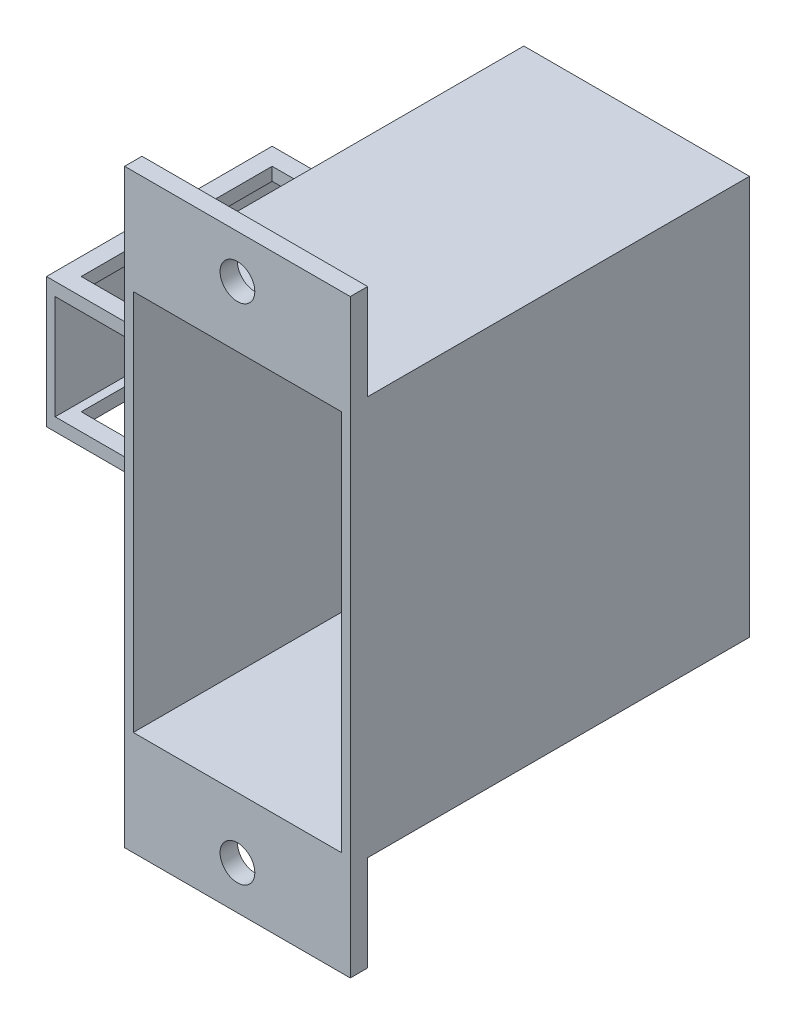
ISO-10303-21;
HEADER;
FILE_DESCRIPTION(('STEP AP214'),'2;1');
FILE_NAME('part.step','',(''),(''),'','','');
FILE_SCHEMA(('AUTOMOTIVE_DESIGN { 1 0 10303 214 1 1 1 1 }'));
ENDSEC;
DATA;
#1=APPLICATION_CONTEXT('core data for automotive mechanical design processes');
#2=APPLICATION_PROTOCOL_DEFINITION('international standard','automotive_design',2000,#1);
#3=PRODUCT_CONTEXT('',#1,'mechanical');
#4=PRODUCT('Part','Part','',(#3));
#5=PRODUCT_RELATED_PRODUCT_CATEGORY('part','',(#4));
#6=PRODUCT_DEFINITION_FORMATION('','',#4);
#7=PRODUCT_DEFINITION_CONTEXT('part definition',#1,'design');
#8=PRODUCT_DEFINITION('design','',#6,#7);
#9=PRODUCT_DEFINITION_SHAPE('','',#8);
#10=(LENGTH_UNIT() NAMED_UNIT(*) SI_UNIT(.MILLI.,.METRE.));
#11=(NAMED_UNIT(*) PLANE_ANGLE_UNIT() SI_UNIT($,.RADIAN.));
#12=(NAMED_UNIT(*) SI_UNIT($,.STERADIAN.) SOLID_ANGLE_UNIT());
#13=UNCERTAINTY_MEASURE_WITH_UNIT(LENGTH_MEASURE(1.E-05),#10,'distance_accuracy_value','');
#14=(GEOMETRIC_REPRESENTATION_CONTEXT(3) GLOBAL_UNCERTAINTY_ASSIGNED_CONTEXT((#13)) GLOBAL_UNIT_ASSIGNED_CONTEXT((#10,
#11,#12)) REPRESENTATION_CONTEXT('',''));
#15=CARTESIAN_POINT('',(0.,0.,0.));
#16=DIRECTION('',(0.,0.,1.));
#17=DIRECTION('',(1.,0.,0.));
#18=AXIS2_PLACEMENT_3D('',#15,#16,#17);
#19=CARTESIAN_POINT('',(-7.5,17.001,16.5));
#20=DIRECTION('',(1.,0.,0.));
#21=DIRECTION('',(0.,1.,0.));
#22=AXIS2_PLACEMENT_3D('',#19,#20,#21);
#23=PLANE('',#22);
#24=DIRECTION('',(0.,-1.,0.));
#25=VECTOR('',#24,1.);
#26=CARTESIAN_POINT('',(-7.5,17.001,16.5));
#27=LINE('',#26,#25);
#28=CARTESIAN_POINT('',(-7.5,-3.,16.5));
#29=VERTEX_POINT('',#28);
#30=CARTESIAN_POINT('',(-7.49999999999999,-3.74999999999999,16.5));
#31=VERTEX_POINT('',#30);
#32=EDGE_CURVE('E250',#29,#31,#27,.T.);
#33=ORIENTED_EDGE('',*,*,#32,.F.);
#34=DIRECTION('',(0.,0.,1.));
#35=VECTOR('',#34,1.);
#36=CARTESIAN_POINT('',(-7.5,-3.,-0.001000000000001));
#37=LINE('',#36,#35);
#38=CARTESIAN_POINT('',(-7.49999999999999,-3.,5.5));
#39=VERTEX_POINT('',#38);
#40=EDGE_CURVE('E555',#39,#29,#37,.T.);
#41=ORIENTED_EDGE('',*,*,#40,.F.);
#42=DIRECTION('',(0.,-1.,0.));
#43=VECTOR('',#42,1.);
#44=CARTESIAN_POINT('',(-7.5,17.001,5.5));
#45=LINE('',#44,#43);
#46=CARTESIAN_POINT('',(-7.5,-3.74999999999999,5.5));
#47=VERTEX_POINT('',#46);
#48=EDGE_CURVE('E611',#39,#47,#45,.T.);
#49=ORIENTED_EDGE('',*,*,#48,.T.);
#50=DIRECTION('',(0.,0.,1.));
#51=VECTOR('',#50,1.);
#52=CARTESIAN_POINT('',(-7.5,-3.74999999999999,16.5));
#53=LINE('',#52,#51);
#54=EDGE_CURVE('E600',#47,#31,#53,.T.);
#55=ORIENTED_EDGE('',*,*,#54,.T.);
#56=EDGE_LOOP('',(#33,#41,#49,#55));
#57=FACE_BOUND('',#56,.T.);
#58=ADVANCED_FACE('F36',(#57),#23,.F.);
#59=CARTESIAN_POINT('',(-15.5,17.001,5.5));
#60=DIRECTION('',(0.,0.,-1.));
#61=DIRECTION('',(-1.,0.,0.));
#62=AXIS2_PLACEMENT_3D('',#59,#60,#61);
#63=PLANE('',#62);
#64=ORIENTED_EDGE('',*,*,#48,.F.);
#65=DIRECTION('',(1.,0.,0.));
#66=VECTOR('',#65,1.);
#67=CARTESIAN_POINT('',(-16.,-3.,5.5));
#68=LINE('',#67,#66);
#69=CARTESIAN_POINT('',(-15.5,-3.,5.5));
#70=VERTEX_POINT('',#69);
#71=EDGE_CURVE('E571',#70,#39,#68,.T.);
#72=ORIENTED_EDGE('',*,*,#71,.F.);
#73=DIRECTION('',(0.,-1.,0.));
#74=VECTOR('',#73,1.);
#75=CARTESIAN_POINT('',(-15.5,17.001,5.5));
#76=LINE('',#75,#74);
#77=CARTESIAN_POINT('',(-15.5,-3.74999999999999,5.5));
#78=VERTEX_POINT('',#77);
#79=EDGE_CURVE('E614',#70,#78,#76,.T.);
#80=ORIENTED_EDGE('',*,*,#79,.T.);
#81=DIRECTION('',(1.,0.,0.));
#82=VECTOR('',#81,1.);
#83=CARTESIAN_POINT('',(-15.5,-3.74999999999999,5.5));
#84=LINE('',#83,#82);
#85=EDGE_CURVE('E254',#78,#47,#84,.T.);
#86=ORIENTED_EDGE('',*,*,#85,.T.);
#87=EDGE_LOOP('',(#64,#72,#80,#86));
#88=FACE_BOUND('',#87,.T.);
#89=ADVANCED_FACE('F442',(#88),#63,.F.);
#90=CARTESIAN_POINT('',(-15.5,17.001,16.5));
#91=DIRECTION('',(-1.,0.,0.));
#92=DIRECTION('',(0.,-1.,0.));
#93=AXIS2_PLACEMENT_3D('',#90,#91,#92);
#94=PLANE('',#93);
#95=ORIENTED_EDGE('',*,*,#79,.F.);
#96=DIRECTION('',(0.,0.,-1.));
#97=VECTOR('',#96,1.);
#98=CARTESIAN_POINT('',(-15.5,-3.,-0.001000000000001));
#99=LINE('',#98,#97);
#100=CARTESIAN_POINT('',(-15.5,-3.,16.5));
#101=VERTEX_POINT('',#100);
#102=EDGE_CURVE('E636',#101,#70,#99,.T.);
#103=ORIENTED_EDGE('',*,*,#102,.F.);
#104=DIRECTION('',(0.,-1.,0.));
#105=VECTOR('',#104,1.);
#106=CARTESIAN_POINT('',(-15.5,17.001,16.5));
#107=LINE('',#106,#105);
#108=CARTESIAN_POINT('',(-15.5,-3.74999999999999,16.5));
#109=VERTEX_POINT('',#108);
#110=EDGE_CURVE('E249',#101,#109,#107,.T.);
#111=ORIENTED_EDGE('',*,*,#110,.T.);
#112=DIRECTION('',(0.,0.,-1.));
#113=VECTOR('',#112,1.);
#114=CARTESIAN_POINT('',(-15.5,-3.74999999999999,16.5));
#115=LINE('',#114,#113);
#116=EDGE_CURVE('E606',#109,#78,#115,.T.);
#117=ORIENTED_EDGE('',*,*,#116,.T.);
#118=EDGE_LOOP('',(#95,#103,#111,#117));
#119=FACE_BOUND('',#118,.T.);
#120=ADVANCED_FACE('F449',(#119),#94,.F.);
#121=CARTESIAN_POINT('',(-15.5,17.001,16.5));
#122=DIRECTION('',(0.,0.,1.));
#123=DIRECTION('',(1.,0.,0.));
#124=AXIS2_PLACEMENT_3D('',#121,#122,#123);
#125=PLANE('',#124);
#126=ORIENTED_EDGE('',*,*,#110,.F.);
#127=DIRECTION('',(-1.,0.,0.));
#128=VECTOR('',#127,1.);
#129=CARTESIAN_POINT('',(-16.,-3.,16.5));
#130=LINE('',#129,#128);
#131=EDGE_CURVE('E635',#29,#101,#130,.T.);
#132=ORIENTED_EDGE('',*,*,#131,.F.);
#133=ORIENTED_EDGE('',*,*,#32,.T.);
#134=DIRECTION('',(-1.,0.,0.));
#135=VECTOR('',#134,1.);
#136=CARTESIAN_POINT('',(-15.5,-3.74999999999999,16.5));
#137=LINE('',#136,#135);
#138=EDGE_CURVE('E603',#31,#109,#137,.T.);
#139=ORIENTED_EDGE('',*,*,#138,.T.);
#140=EDGE_LOOP('',(#126,#132,#133,#139));
#141=FACE_BOUND('',#140,.T.);
#142=ADVANCED_FACE('F519',(#141),#125,.F.);
#143=CARTESIAN_POINT('',(-6.5,11.5,23.));
#144=DIRECTION('',(1.,0.,0.));
#145=DIRECTION('',(0.,1.,0.));
#146=AXIS2_PLACEMENT_3D('',#143,#144,#145);
#147=PLANE('',#146);
#148=DIRECTION('',(0.,-1.,0.));
#149=VECTOR('',#148,1.);
#150=CARTESIAN_POINT('',(-6.5,11.5,0.));
#151=LINE('',#150,#149);
#152=CARTESIAN_POINT('',(-6.5,11.5,0.));
#153=VERTEX_POINT('',#152);
#154=CARTESIAN_POINT('',(-6.5,-11.5,0.));
#155=VERTEX_POINT('',#154);
#156=EDGE_CURVE('E381',#153,#155,#151,.T.);
#157=ORIENTED_EDGE('',*,*,#156,.T.);
#158=DIRECTION('',(0.,0.,-1.));
#159=VECTOR('',#158,1.);
#160=CARTESIAN_POINT('',(-6.5,-11.5,23.));
#161=LINE('',#160,#159);
#162=CARTESIAN_POINT('',(-6.5,-11.5,22.));
#163=VERTEX_POINT('',#162);
#164=EDGE_CURVE('E45',#163,#155,#161,.T.);
#165=ORIENTED_EDGE('',*,*,#164,.F.);
#166=DIRECTION('',(0.,-1.,0.));
#167=VECTOR('',#166,1.);
#168=CARTESIAN_POINT('',(-6.49999999999999,-11.5,22.));
#169=LINE('',#168,#167);
#170=CARTESIAN_POINT('',(-6.5,-17.,22.));
#171=VERTEX_POINT('',#170);
#172=EDGE_CURVE('E307',#163,#171,#169,.T.);
#173=ORIENTED_EDGE('',*,*,#172,.T.);
#174=DIRECTION('',(0.,0.,1.));
#175=VECTOR('',#174,1.);
#176=CARTESIAN_POINT('',(-6.5,-17.,22.));
#177=LINE('',#176,#175);
#178=CARTESIAN_POINT('',(-6.5,-17.,23.));
#179=VERTEX_POINT('',#178);
#180=EDGE_CURVE('E313',#171,#179,#177,.T.);
#181=ORIENTED_EDGE('',*,*,#180,.T.);
#182=DIRECTION('',(0.,-1.,0.));
#183=VECTOR('',#182,1.);
#184=CARTESIAN_POINT('',(-6.5,11.5,23.));
#185=LINE('',#184,#183);
#186=CARTESIAN_POINT('',(-6.5,17.,23.));
#187=VERTEX_POINT('',#186);
#188=EDGE_CURVE('E380',#187,#179,#185,.T.);
#189=ORIENTED_EDGE('',*,*,#188,.F.);
#190=DIRECTION('',(0.,0.,1.));
#191=VECTOR('',#190,1.);
#192=CARTESIAN_POINT('',(-6.5,17.,22.));
#193=LINE('',#192,#191);
#194=CARTESIAN_POINT('',(-6.5,17.,22.));
#195=VERTEX_POINT('',#194);
#196=EDGE_CURVE('E340',#195,#187,#193,.T.);
#197=ORIENTED_EDGE('',*,*,#196,.F.);
#198=DIRECTION('',(0.,-1.,0.));
#199=VECTOR('',#198,1.);
#200=CARTESIAN_POINT('',(-6.5,11.5,22.));
#201=LINE('',#200,#199);
#202=CARTESIAN_POINT('',(-6.5,11.5,22.));
#203=VERTEX_POINT('',#202);
#204=EDGE_CURVE('E334',#195,#203,#201,.T.);
#205=ORIENTED_EDGE('',*,*,#204,.T.);
#206=DIRECTION('',(0.,0.,-1.));
#207=VECTOR('',#206,1.);
#208=CARTESIAN_POINT('',(-6.5,11.5,23.));
#209=LINE('',#208,#207);
#210=EDGE_CURVE('E11',#203,#153,#209,.T.);
#211=ORIENTED_EDGE('',*,*,#210,.T.);
#212=EDGE_LOOP('',(#157,#165,#173,#181,#189,#197,#205,#211));
#213=FACE_BOUND('',#212,.T.);
#214=DIRECTION('',(0.,1.,0.));
#215=VECTOR('',#214,1.);
#216=CARTESIAN_POINT('',(-6.5,3.75000000000001,17.5));
#217=LINE('',#216,#215);
#218=CARTESIAN_POINT('',(-6.5,-3.74999999999999,17.5));
#219=VERTEX_POINT('',#218);
#220=CARTESIAN_POINT('',(-6.5,3.75000000000001,17.5));
#221=VERTEX_POINT('',#220);
#222=EDGE_CURVE('E258',#219,#221,#217,.T.);
#223=ORIENTED_EDGE('',*,*,#222,.F.);
#224=DIRECTION('',(0.,0.,1.));
#225=VECTOR('',#224,1.);
#226=CARTESIAN_POINT('',(-6.5,-3.74999999999999,4.5));
#227=LINE('',#226,#225);
#228=CARTESIAN_POINT('',(-6.5,-3.74999999999999,4.5));
#229=VERTEX_POINT('',#228);
#230=EDGE_CURVE('E263',#229,#219,#227,.T.);
#231=ORIENTED_EDGE('',*,*,#230,.F.);
#232=DIRECTION('',(0.,-1.,0.));
#233=VECTOR('',#232,1.);
#234=CARTESIAN_POINT('',(-6.5,3.75000000000001,4.5));
#235=LINE('',#234,#233);
#236=CARTESIAN_POINT('',(-6.5,3.75000000000001,4.5));
#237=VERTEX_POINT('',#236);
#238=EDGE_CURVE('E275',#237,#229,#235,.T.);
#239=ORIENTED_EDGE('',*,*,#238,.F.);
#240=DIRECTION('',(0.,0.,-1.));
#241=VECTOR('',#240,1.);
#242=CARTESIAN_POINT('',(-6.5,3.75000000000001,4.5));
#243=LINE('',#242,#241);
#244=EDGE_CURVE('E272',#221,#237,#243,.T.);
#245=ORIENTED_EDGE('',*,*,#244,.F.);
#246=EDGE_LOOP('',(#223,#231,#239,#245));
#247=FACE_BOUND('',#246,.T.);
#248=ADVANCED_FACE('F409',(#213,#247),#147,.F.);
#249=CARTESIAN_POINT('',(-6.5,11.5,23.));
#250=DIRECTION('',(0.,1.,0.));
#251=DIRECTION('',(0.,0.,1.));
#252=AXIS2_PLACEMENT_3D('',#249,#250,#251);
#253=PLANE('',#252);
#254=ORIENTED_EDGE('',*,*,#210,.F.);
#255=DIRECTION('',(1.,0.,0.));
#256=VECTOR('',#255,1.);
#257=CARTESIAN_POINT('',(6.5,11.5,22.));
#258=LINE('',#257,#256);
#259=CARTESIAN_POINT('',(6.5,11.5,22.));
#260=VERTEX_POINT('',#259);
#261=EDGE_CURVE('E325',#203,#260,#258,.T.);
#262=ORIENTED_EDGE('',*,*,#261,.T.);
#263=DIRECTION('',(0.,0.,-1.));
#264=VECTOR('',#263,1.);
#265=CARTESIAN_POINT('',(6.5,11.5,23.));
#266=LINE('',#265,#264);
#267=CARTESIAN_POINT('',(6.5,11.5,0.));
#268=VERTEX_POINT('',#267);
#269=EDGE_CURVE('E40',#260,#268,#266,.T.);
#270=ORIENTED_EDGE('',*,*,#269,.T.);
#271=DIRECTION('',(1.,0.,0.));
#272=VECTOR('',#271,1.);
#273=CARTESIAN_POINT('',(-6.5,11.5,0.));
#274=LINE('',#273,#272);
#275=EDGE_CURVE('E377',#153,#268,#274,.T.);
#276=ORIENTED_EDGE('',*,*,#275,.F.);
#277=EDGE_LOOP('',(#254,#262,#270,#276));
#278=FACE_BOUND('',#277,.T.);
#279=ADVANCED_FACE('F38',(#278),#253,.T.);
#280=CARTESIAN_POINT('',(0.,0.,23.));
#281=DIRECTION('',(0.,0.,-1.));
#282=DIRECTION('',(-1.,0.,0.));
#283=AXIS2_PLACEMENT_3D('',#280,#281,#282);
#284=PLANE('',#283);
#285=DIRECTION('',(0.,-1.,0.));
#286=VECTOR('',#285,1.);
#287=CARTESIAN_POINT('',(6.5,11.5,23.));
#288=LINE('',#287,#286);
#289=CARTESIAN_POINT('',(6.5,17.,23.));
#290=VERTEX_POINT('',#289);
#291=CARTESIAN_POINT('',(6.5,-17.,23.));
#292=VERTEX_POINT('',#291);
#293=EDGE_CURVE('E378',#290,#292,#288,.T.);
#294=ORIENTED_EDGE('',*,*,#293,.F.);
#295=DIRECTION('',(-1.,0.,0.));
#296=VECTOR('',#295,1.);
#297=CARTESIAN_POINT('',(-6.5,17.,23.));
#298=LINE('',#297,#296);
#299=EDGE_CURVE('E322',#290,#187,#298,.T.);
#300=ORIENTED_EDGE('',*,*,#299,.T.);
#301=ORIENTED_EDGE('',*,*,#188,.T.);
#302=DIRECTION('',(1.,0.,0.));
#303=VECTOR('',#302,1.);
#304=CARTESIAN_POINT('',(-6.5,-17.,23.));
#305=LINE('',#304,#303);
#306=EDGE_CURVE('E295',#179,#292,#305,.T.);
#307=ORIENTED_EDGE('',*,*,#306,.T.);
#308=EDGE_LOOP('',(#294,#300,#301,#307));
#309=FACE_BOUND('',#308,.T.);
#310=DIRECTION('',(0.,1.,0.));
#311=VECTOR('',#310,1.);
#312=CARTESIAN_POINT('',(-6.,11.,23.));
#313=LINE('',#312,#311);
#314=CARTESIAN_POINT('',(-6.,-11.,23.));
#315=VERTEX_POINT('',#314);
#316=CARTESIAN_POINT('',(-6.,11.,23.));
#317=VERTEX_POINT('',#316);
#318=EDGE_CURVE('E350',#315,#317,#313,.T.);
#319=ORIENTED_EDGE('',*,*,#318,.T.);
#320=DIRECTION('',(-1.,0.,0.));
#321=VECTOR('',#320,1.);
#322=CARTESIAN_POINT('',(-6.,11.,23.));
#323=LINE('',#322,#321);
#324=CARTESIAN_POINT('',(6.,11.,23.));
#325=VERTEX_POINT('',#324);
#326=EDGE_CURVE('E374',#325,#317,#323,.T.);
#327=ORIENTED_EDGE('',*,*,#326,.F.);
#328=DIRECTION('',(0.,1.,0.));
#329=VECTOR('',#328,1.);
#330=CARTESIAN_POINT('',(6.,11.,23.));
#331=LINE('',#330,#329);
#332=CARTESIAN_POINT('',(6.,-11.,23.));
#333=VERTEX_POINT('',#332);
#334=EDGE_CURVE('E343',#333,#325,#331,.T.);
#335=ORIENTED_EDGE('',*,*,#334,.F.);
#336=DIRECTION('',(-1.,0.,0.));
#337=VECTOR('',#336,1.);
#338=CARTESIAN_POINT('',(-6.,-11.,23.));
#339=LINE('',#338,#337);
#340=EDGE_CURVE('E347',#333,#315,#339,.T.);
#341=ORIENTED_EDGE('',*,*,#340,.T.);
#342=EDGE_LOOP('',(#319,#327,#335,#341));
#343=FACE_BOUND('',#342,.T.);
#344=CARTESIAN_POINT('',(0.,14.5,23.));
#345=DIRECTION('',(0.,0.,1.));
#346=DIRECTION('',(1.,0.,0.));
#347=AXIS2_PLACEMENT_3D('',#344,#345,#346);
#348=CIRCLE('',#347,1.);
#349=CARTESIAN_POINT('',(1.,14.5,23.));
#350=VERTEX_POINT('',#349);
#351=EDGE_CURVE('E316',#350,#350,#348,.T.);
#352=ORIENTED_EDGE('',*,*,#351,.F.);
#353=EDGE_LOOP('',(#352));
#354=FACE_BOUND('',#353,.T.);
#355=CARTESIAN_POINT('',(0.,-14.5,23.));
#356=DIRECTION('',(0.,0.,1.));
#357=DIRECTION('',(-1.,0.,0.));
#358=AXIS2_PLACEMENT_3D('',#355,#356,#357);
#359=CIRCLE('',#358,1.);
#360=CARTESIAN_POINT('',(-1.,-14.5,23.));
#361=VERTEX_POINT('',#360);
#362=EDGE_CURVE('E291',#361,#361,#359,.T.);
#363=ORIENTED_EDGE('',*,*,#362,.F.);
#364=EDGE_LOOP('',(#363));
#365=FACE_BOUND('',#364,.T.);
#366=ADVANCED_FACE('F419',(#309,#343,#354,#365),#284,.F.);
#367=CARTESIAN_POINT('',(0.,0.,0.));
#368=DIRECTION('',(0.,0.,-1.));
#369=DIRECTION('',(-1.,0.,0.));
#370=AXIS2_PLACEMENT_3D('',#367,#368,#369);
#371=PLANE('',#370);
#372=ORIENTED_EDGE('',*,*,#275,.T.);
#373=DIRECTION('',(0.,-1.,0.));
#374=VECTOR('',#373,1.);
#375=CARTESIAN_POINT('',(6.5,11.5,0.));
#376=LINE('',#375,#374);
#377=CARTESIAN_POINT('',(6.5,-11.5,0.));
#378=VERTEX_POINT('',#377);
#379=EDGE_CURVE('E385',#268,#378,#376,.T.);
#380=ORIENTED_EDGE('',*,*,#379,.T.);
#381=DIRECTION('',(1.,0.,0.));
#382=VECTOR('',#381,1.);
#383=CARTESIAN_POINT('',(-6.5,-11.5,0.));
#384=LINE('',#383,#382);
#385=EDGE_CURVE('E388',#155,#378,#384,.T.);
#386=ORIENTED_EDGE('',*,*,#385,.F.);
#387=ORIENTED_EDGE('',*,*,#156,.F.);
#388=EDGE_LOOP('',(#372,#380,#386,#387));
#389=FACE_BOUND('',#388,.T.);
#390=DIRECTION('',(1.,0.,0.));
#391=VECTOR('',#390,1.);
#392=CARTESIAN_POINT('',(-6.,11.,0.));
#393=LINE('',#392,#391);
#394=CARTESIAN_POINT('',(-6.,11.,0.));
#395=VERTEX_POINT('',#394);
#396=CARTESIAN_POINT('',(6.,11.,0.));
#397=VERTEX_POINT('',#396);
#398=EDGE_CURVE('E362',#395,#397,#393,.T.);
#399=ORIENTED_EDGE('',*,*,#398,.F.);
#400=DIRECTION('',(0.,-1.,0.));
#401=VECTOR('',#400,1.);
#402=CARTESIAN_POINT('',(-6.,11.,0.));
#403=LINE('',#402,#401);
#404=CARTESIAN_POINT('',(-6.,-11.,0.));
#405=VERTEX_POINT('',#404);
#406=EDGE_CURVE('E353',#395,#405,#403,.T.);
#407=ORIENTED_EDGE('',*,*,#406,.T.);
#408=DIRECTION('',(1.,0.,0.));
#409=VECTOR('',#408,1.);
#410=CARTESIAN_POINT('',(-6.,-11.,0.));
#411=LINE('',#410,#409);
#412=CARTESIAN_POINT('',(6.,-11.,0.));
#413=VERTEX_POINT('',#412);
#414=EDGE_CURVE('E356',#405,#413,#411,.T.);
#415=ORIENTED_EDGE('',*,*,#414,.T.);
#416=DIRECTION('',(0.,-1.,0.));
#417=VECTOR('',#416,1.);
#418=CARTESIAN_POINT('',(6.,11.,0.));
#419=LINE('',#418,#417);
#420=EDGE_CURVE('E359',#397,#413,#419,.T.);
#421=ORIENTED_EDGE('',*,*,#420,.F.);
#422=EDGE_LOOP('',(#399,#407,#415,#421));
#423=FACE_BOUND('',#422,.T.);
#424=ADVANCED_FACE('F405',(#389,#423),#371,.T.);
#425=CARTESIAN_POINT('',(-6.5,-11.5,23.));
#426=DIRECTION('',(0.,1.,0.));
#427=DIRECTION('',(0.,0.,1.));
#428=AXIS2_PLACEMENT_3D('',#425,#426,#427);
#429=PLANE('',#428);
#430=DIRECTION('',(0.,0.,-1.));
#431=VECTOR('',#430,1.);
#432=CARTESIAN_POINT('',(6.5,-11.5,23.));
#433=LINE('',#432,#431);
#434=CARTESIAN_POINT('',(6.5,-11.5,22.));
#435=VERTEX_POINT('',#434);
#436=EDGE_CURVE('E393',#435,#378,#433,.T.);
#437=ORIENTED_EDGE('',*,*,#436,.F.);
#438=DIRECTION('',(-1.,0.,0.));
#439=VECTOR('',#438,1.);
#440=CARTESIAN_POINT('',(6.5,-11.5,22.));
#441=LINE('',#440,#439);
#442=EDGE_CURVE('E304',#435,#163,#441,.T.);
#443=ORIENTED_EDGE('',*,*,#442,.T.);
#444=ORIENTED_EDGE('',*,*,#164,.T.);
#445=ORIENTED_EDGE('',*,*,#385,.T.);
#446=EDGE_LOOP('',(#437,#443,#444,#445));
#447=FACE_BOUND('',#446,.T.);
#448=ADVANCED_FACE('F429',(#447),#429,.F.);
#449=CARTESIAN_POINT('',(6.5,11.5,23.));
#450=DIRECTION('',(1.,0.,0.));
#451=DIRECTION('',(0.,1.,0.));
#452=AXIS2_PLACEMENT_3D('',#449,#450,#451);
#453=PLANE('',#452);
#454=ORIENTED_EDGE('',*,*,#379,.F.);
#455=ORIENTED_EDGE('',*,*,#269,.F.);
#456=DIRECTION('',(0.,1.,0.));
#457=VECTOR('',#456,1.);
#458=CARTESIAN_POINT('',(6.5,17.,22.));
#459=LINE('',#458,#457);
#460=CARTESIAN_POINT('',(6.5,17.,22.));
#461=VERTEX_POINT('',#460);
#462=EDGE_CURVE('E328',#260,#461,#459,.T.);
#463=ORIENTED_EDGE('',*,*,#462,.T.);
#464=DIRECTION('',(0.,0.,1.));
#465=VECTOR('',#464,1.);
#466=CARTESIAN_POINT('',(6.5,17.,22.));
#467=LINE('',#466,#465);
#468=EDGE_CURVE('E337',#461,#290,#467,.T.);
#469=ORIENTED_EDGE('',*,*,#468,.T.);
#470=ORIENTED_EDGE('',*,*,#293,.T.);
#471=DIRECTION('',(0.,0.,1.));
#472=VECTOR('',#471,1.);
#473=CARTESIAN_POINT('',(6.5,-17.,22.));
#474=LINE('',#473,#472);
#475=CARTESIAN_POINT('',(6.5,-17.,22.));
#476=VERTEX_POINT('',#475);
#477=EDGE_CURVE('E310',#476,#292,#474,.T.);
#478=ORIENTED_EDGE('',*,*,#477,.F.);
#479=DIRECTION('',(0.,1.,0.));
#480=VECTOR('',#479,1.);
#481=CARTESIAN_POINT('',(6.5,-17.,22.));
#482=LINE('',#481,#480);
#483=EDGE_CURVE('E301',#476,#435,#482,.T.);
#484=ORIENTED_EDGE('',*,*,#483,.T.);
#485=ORIENTED_EDGE('',*,*,#436,.T.);
#486=EDGE_LOOP('',(#454,#455,#463,#469,#470,#478,#484,#485));
#487=FACE_BOUND('',#486,.T.);
#488=ADVANCED_FACE('F401',(#487),#453,.T.);
#489=CARTESIAN_POINT('',(-6.,11.,23.001));
#490=DIRECTION('',(1.,0.,0.));
#491=DIRECTION('',(0.,1.,0.));
#492=AXIS2_PLACEMENT_3D('',#489,#490,#491);
#493=PLANE('',#492);
#494=DIRECTION('',(0.,0.,-1.));
#495=VECTOR('',#494,1.);
#496=CARTESIAN_POINT('',(-6.,-11.,23.001));
#497=LINE('',#496,#495);
#498=EDGE_CURVE('E372',#315,#405,#497,.T.);
#499=ORIENTED_EDGE('',*,*,#498,.T.);
#500=ORIENTED_EDGE('',*,*,#406,.F.);
#501=DIRECTION('',(0.,0.,-1.));
#502=VECTOR('',#501,1.);
#503=CARTESIAN_POINT('',(-6.,11.,23.001));
#504=LINE('',#503,#502);
#505=EDGE_CURVE('E365',#317,#395,#504,.T.);
#506=ORIENTED_EDGE('',*,*,#505,.F.);
#507=ORIENTED_EDGE('',*,*,#318,.F.);
#508=EDGE_LOOP('',(#499,#500,#506,#507));
#509=FACE_BOUND('',#508,.T.);
#510=ADVANCED_FACE('F437',(#509),#493,.T.);
#511=CARTESIAN_POINT('',(-6.,-11.,23.001));
#512=DIRECTION('',(0.,1.,0.));
#513=DIRECTION('',(0.,0.,1.));
#514=AXIS2_PLACEMENT_3D('',#511,#512,#513);
#515=PLANE('',#514);
#516=DIRECTION('',(0.,0.,-1.));
#517=VECTOR('',#516,1.);
#518=CARTESIAN_POINT('',(6.,-11.,23.001));
#519=LINE('',#518,#517);
#520=EDGE_CURVE('E370',#333,#413,#519,.T.);
#521=ORIENTED_EDGE('',*,*,#520,.T.);
#522=ORIENTED_EDGE('',*,*,#414,.F.);
#523=ORIENTED_EDGE('',*,*,#498,.F.);
#524=ORIENTED_EDGE('',*,*,#340,.F.);
#525=EDGE_LOOP('',(#521,#522,#523,#524));
#526=FACE_BOUND('',#525,.T.);
#527=ADVANCED_FACE('F509',(#526),#515,.T.);
#528=CARTESIAN_POINT('',(6.,11.,23.001));
#529=DIRECTION('',(1.,0.,0.));
#530=DIRECTION('',(0.,1.,0.));
#531=AXIS2_PLACEMENT_3D('',#528,#529,#530);
#532=PLANE('',#531);
#533=ORIENTED_EDGE('',*,*,#334,.T.);
#534=DIRECTION('',(0.,0.,-1.));
#535=VECTOR('',#534,1.);
#536=CARTESIAN_POINT('',(6.,11.,23.001));
#537=LINE('',#536,#535);
#538=EDGE_CURVE('E368',#325,#397,#537,.T.);
#539=ORIENTED_EDGE('',*,*,#538,.T.);
#540=ORIENTED_EDGE('',*,*,#420,.T.);
#541=ORIENTED_EDGE('',*,*,#520,.F.);
#542=EDGE_LOOP('',(#533,#539,#540,#541));
#543=FACE_BOUND('',#542,.T.);
#544=ADVANCED_FACE('F505',(#543),#532,.F.);
#545=CARTESIAN_POINT('',(-6.,11.,23.001));
#546=DIRECTION('',(0.,1.,0.));
#547=DIRECTION('',(0.,0.,1.));
#548=AXIS2_PLACEMENT_3D('',#545,#546,#547);
#549=PLANE('',#548);
#550=ORIENTED_EDGE('',*,*,#326,.T.);
#551=ORIENTED_EDGE('',*,*,#505,.T.);
#552=ORIENTED_EDGE('',*,*,#398,.T.);
#553=ORIENTED_EDGE('',*,*,#538,.F.);
#554=EDGE_LOOP('',(#550,#551,#552,#553));
#555=FACE_BOUND('',#554,.T.);
#556=ADVANCED_FACE('F502',(#555),#549,.F.);
#557=CARTESIAN_POINT('',(-6.5,17.,22.));
#558=DIRECTION('',(0.,1.,0.));
#559=DIRECTION('',(0.,0.,1.));
#560=AXIS2_PLACEMENT_3D('',#557,#558,#559);
#561=PLANE('',#560);
#562=ORIENTED_EDGE('',*,*,#299,.F.);
#563=ORIENTED_EDGE('',*,*,#468,.F.);
#564=DIRECTION('',(-1.,0.,0.));
#565=VECTOR('',#564,1.);
#566=CARTESIAN_POINT('',(-6.5,17.,22.));
#567=LINE('',#566,#565);
#568=EDGE_CURVE('E331',#461,#195,#567,.T.);
#569=ORIENTED_EDGE('',*,*,#568,.T.);
#570=ORIENTED_EDGE('',*,*,#196,.T.);
#571=EDGE_LOOP('',(#562,#563,#569,#570));
#572=FACE_BOUND('',#571,.T.);
#573=ADVANCED_FACE('F417',(#572),#561,.T.);
#574=CARTESIAN_POINT('',(0.,0.,22.));
#575=DIRECTION('',(0.,0.,-1.));
#576=DIRECTION('',(-1.,0.,0.));
#577=AXIS2_PLACEMENT_3D('',#574,#575,#576);
#578=PLANE('',#577);
#579=CARTESIAN_POINT('',(0.,14.5,22.));
#580=DIRECTION('',(0.,0.,1.));
#581=DIRECTION('',(1.,0.,0.));
#582=AXIS2_PLACEMENT_3D('',#579,#580,#581);
#583=CIRCLE('',#582,1.);
#584=CARTESIAN_POINT('',(1.,14.5,22.));
#585=VERTEX_POINT('',#584);
#586=EDGE_CURVE('E319',#585,#585,#583,.T.);
#587=ORIENTED_EDGE('',*,*,#586,.T.);
#588=EDGE_LOOP('',(#587));
#589=FACE_BOUND('',#588,.T.);
#590=ORIENTED_EDGE('',*,*,#261,.F.);
#591=ORIENTED_EDGE('',*,*,#204,.F.);
#592=ORIENTED_EDGE('',*,*,#568,.F.);
#593=ORIENTED_EDGE('',*,*,#462,.F.);
#594=EDGE_LOOP('',(#590,#591,#592,#593));
#595=FACE_BOUND('',#594,.T.);
#596=ADVANCED_FACE('F414',(#589,#595),#578,.T.);
#597=CARTESIAN_POINT('',(0.,14.5,22.));
#598=DIRECTION('',(0.,0.,1.));
#599=DIRECTION('',(1.,0.,0.));
#600=AXIS2_PLACEMENT_3D('',#597,#598,#599);
#601=CYLINDRICAL_SURFACE('',#600,1.);
#602=ORIENTED_EDGE('',*,*,#586,.F.);
#603=EDGE_LOOP('',(#602));
#604=FACE_BOUND('',#603,.T.);
#605=ORIENTED_EDGE('',*,*,#351,.T.);
#606=EDGE_LOOP('',(#605));
#607=FACE_BOUND('',#606,.T.);
#608=ADVANCED_FACE('F493',(#604,#607),#601,.F.);
#609=CARTESIAN_POINT('',(-6.5,-17.,22.));
#610=DIRECTION('',(0.,-1.,0.));
#611=DIRECTION('',(0.,0.,-1.));
#612=AXIS2_PLACEMENT_3D('',#609,#610,#611);
#613=PLANE('',#612);
#614=ORIENTED_EDGE('',*,*,#306,.F.);
#615=ORIENTED_EDGE('',*,*,#180,.F.);
#616=DIRECTION('',(1.,0.,0.));
#617=VECTOR('',#616,1.);
#618=CARTESIAN_POINT('',(-6.5,-17.,22.));
#619=LINE('',#618,#617);
#620=EDGE_CURVE('E298',#171,#476,#619,.T.);
#621=ORIENTED_EDGE('',*,*,#620,.T.);
#622=ORIENTED_EDGE('',*,*,#477,.T.);
#623=EDGE_LOOP('',(#614,#615,#621,#622));
#624=FACE_BOUND('',#623,.T.);
#625=ADVANCED_FACE('F423',(#624),#613,.T.);
#626=CARTESIAN_POINT('',(0.,0.,22.));
#627=DIRECTION('',(0.,0.,1.));
#628=DIRECTION('',(1.,0.,0.));
#629=AXIS2_PLACEMENT_3D('',#626,#627,#628);
#630=PLANE('',#629);
#631=CARTESIAN_POINT('',(0.,-14.5,22.));
#632=DIRECTION('',(0.,0.,1.));
#633=DIRECTION('',(-1.,0.,0.));
#634=AXIS2_PLACEMENT_3D('',#631,#632,#633);
#635=CIRCLE('',#634,1.);
#636=CARTESIAN_POINT('',(-1.,-14.5,22.));
#637=VERTEX_POINT('',#636);
#638=EDGE_CURVE('E292',#637,#637,#635,.T.);
#639=ORIENTED_EDGE('',*,*,#638,.T.);
#640=EDGE_LOOP('',(#639));
#641=FACE_BOUND('',#640,.T.);
#642=ORIENTED_EDGE('',*,*,#620,.F.);
#643=ORIENTED_EDGE('',*,*,#172,.F.);
#644=ORIENTED_EDGE('',*,*,#442,.F.);
#645=ORIENTED_EDGE('',*,*,#483,.F.);
#646=EDGE_LOOP('',(#642,#643,#644,#645));
#647=FACE_BOUND('',#646,.T.);
#648=ADVANCED_FACE('F427',(#641,#647),#630,.F.);
#649=CARTESIAN_POINT('',(0.,-14.5,22.));
#650=DIRECTION('',(0.,0.,1.));
#651=DIRECTION('',(1.,0.,0.));
#652=AXIS2_PLACEMENT_3D('',#649,#650,#651);
#653=CYLINDRICAL_SURFACE('',#652,1.);
#654=ORIENTED_EDGE('',*,*,#638,.F.);
#655=EDGE_LOOP('',(#654));
#656=FACE_BOUND('',#655,.T.);
#657=ORIENTED_EDGE('',*,*,#362,.T.);
#658=EDGE_LOOP('',(#657));
#659=FACE_BOUND('',#658,.T.);
#660=ADVANCED_FACE('F483',(#656,#659),#653,.F.);
#661=CARTESIAN_POINT('',(-16.5,3.75000000000001,17.5));
#662=DIRECTION('',(0.,0.,-1.));
#663=DIRECTION('',(-1.,0.,0.));
#664=AXIS2_PLACEMENT_3D('',#661,#662,#663);
#665=PLANE('',#664);
#666=DIRECTION('',(-1.,0.,0.));
#667=VECTOR('',#666,1.);
#668=CARTESIAN_POINT('',(-16.,3.,17.5));
#669=LINE('',#668,#667);
#670=CARTESIAN_POINT('',(-7.,3.,17.5));
#671=VERTEX_POINT('',#670);
#672=CARTESIAN_POINT('',(-16.,3.,17.5));
#673=VERTEX_POINT('',#672);
#674=EDGE_CURVE('E577',#671,#673,#669,.T.);
#675=ORIENTED_EDGE('',*,*,#674,.F.);
#676=DIRECTION('',(0.,1.,0.));
#677=VECTOR('',#676,1.);
#678=CARTESIAN_POINT('',(-7.,3.,17.5));
#679=LINE('',#678,#677);
#680=CARTESIAN_POINT('',(-7.,-3.,17.5));
#681=VERTEX_POINT('',#680);
#682=EDGE_CURVE('E53',#681,#671,#679,.T.);
#683=ORIENTED_EDGE('',*,*,#682,.F.);
#684=DIRECTION('',(1.,0.,0.));
#685=VECTOR('',#684,1.);
#686=CARTESIAN_POINT('',(-16.,-3.,17.5));
#687=LINE('',#686,#685);
#688=CARTESIAN_POINT('',(-16.,-3.,17.5));
#689=VERTEX_POINT('',#688);
#690=EDGE_CURVE('E582',#689,#681,#687,.T.);
#691=ORIENTED_EDGE('',*,*,#690,.F.);
#692=DIRECTION('',(0.,-1.,0.));
#693=VECTOR('',#692,1.);
#694=CARTESIAN_POINT('',(-16.,3.,17.5));
#695=LINE('',#694,#693);
#696=EDGE_CURVE('E580',#673,#689,#695,.T.);
#697=ORIENTED_EDGE('',*,*,#696,.F.);
#698=EDGE_LOOP('',(#675,#683,#691,#697));
#699=FACE_BOUND('',#698,.T.);
#700=ORIENTED_EDGE('',*,*,#222,.T.);
#701=DIRECTION('',(1.,0.,0.));
#702=VECTOR('',#701,1.);
#703=CARTESIAN_POINT('',(-16.5,3.75000000000001,17.5));
#704=LINE('',#703,#702);
#705=CARTESIAN_POINT('',(-16.5,3.75000000000001,17.5));
#706=VERTEX_POINT('',#705);
#707=EDGE_CURVE('E288',#706,#221,#704,.T.);
#708=ORIENTED_EDGE('',*,*,#707,.F.);
#709=DIRECTION('',(0.,1.,0.));
#710=VECTOR('',#709,1.);
#711=CARTESIAN_POINT('',(-16.5,3.75000000000001,17.5));
#712=LINE('',#711,#710);
#713=CARTESIAN_POINT('',(-16.5,-3.74999999999999,17.5));
#714=VERTEX_POINT('',#713);
#715=EDGE_CURVE('E259',#714,#706,#712,.T.);
#716=ORIENTED_EDGE('',*,*,#715,.F.);
#717=DIRECTION('',(1.,0.,0.));
#718=VECTOR('',#717,1.);
#719=CARTESIAN_POINT('',(-16.5,-3.74999999999999,17.5));
#720=LINE('',#719,#718);
#721=EDGE_CURVE('E269',#714,#219,#720,.T.);
#722=ORIENTED_EDGE('',*,*,#721,.T.);
#723=EDGE_LOOP('',(#700,#708,#716,#722));
#724=FACE_BOUND('',#723,.T.);
#725=ADVANCED_FACE('F479',(#699,#724),#665,.F.);
#726=CARTESIAN_POINT('',(-16.5,3.75000000000001,4.5));
#727=DIRECTION('',(0.,-1.,0.));
#728=DIRECTION('',(1.,0.,0.));
#729=AXIS2_PLACEMENT_3D('',#726,#727,#728);
#730=PLANE('',#729);
#731=DIRECTION('',(-1.,0.,0.));
#732=VECTOR('',#731,1.);
#733=CARTESIAN_POINT('',(-15.5,3.75000000000001,5.5));
#734=LINE('',#733,#732);
#735=CARTESIAN_POINT('',(-7.5,3.75000000000001,5.5));
#736=VERTEX_POINT('',#735);
#737=CARTESIAN_POINT('',(-15.5,3.75000000000001,5.5));
#738=VERTEX_POINT('',#737);
#739=EDGE_CURVE('E595',#736,#738,#734,.T.);
#740=ORIENTED_EDGE('',*,*,#739,.F.);
#741=DIRECTION('',(0.,0.,-1.));
#742=VECTOR('',#741,1.);
#743=CARTESIAN_POINT('',(-7.5,3.75000000000001,16.5));
#744=LINE('',#743,#742);
#745=CARTESIAN_POINT('',(-7.5,3.75000000000001,16.5));
#746=VERTEX_POINT('',#745);
#747=EDGE_CURVE('E598',#746,#736,#744,.T.);
#748=ORIENTED_EDGE('',*,*,#747,.F.);
#749=DIRECTION('',(1.,0.,0.));
#750=VECTOR('',#749,1.);
#751=CARTESIAN_POINT('',(-15.5,3.75000000000001,16.5));
#752=LINE('',#751,#750);
#753=CARTESIAN_POINT('',(-15.5,3.75000000000001,16.5));
#754=VERTEX_POINT('',#753);
#755=EDGE_CURVE('E247',#754,#746,#752,.T.);
#756=ORIENTED_EDGE('',*,*,#755,.F.);
#757=DIRECTION('',(0.,0.,1.));
#758=VECTOR('',#757,1.);
#759=CARTESIAN_POINT('',(-15.5,3.75000000000001,16.5));
#760=LINE('',#759,#758);
#761=EDGE_CURVE('E593',#738,#754,#760,.T.);
#762=ORIENTED_EDGE('',*,*,#761,.F.);
#763=EDGE_LOOP('',(#740,#748,#756,#762));
#764=FACE_BOUND('',#763,.T.);
#765=ORIENTED_EDGE('',*,*,#244,.T.);
#766=DIRECTION('',(1.,0.,0.));
#767=VECTOR('',#766,1.);
#768=CARTESIAN_POINT('',(-16.5,3.75000000000001,4.5));
#769=LINE('',#768,#767);
#770=CARTESIAN_POINT('',(-16.5,3.75000000000001,4.5));
#771=VERTEX_POINT('',#770);
#772=EDGE_CURVE('E285',#771,#237,#769,.T.);
#773=ORIENTED_EDGE('',*,*,#772,.F.);
#774=DIRECTION('',(0.,0.,-1.));
#775=VECTOR('',#774,1.);
#776=CARTESIAN_POINT('',(-16.5,3.75000000000001,4.5));
#777=LINE('',#776,#775);
#778=EDGE_CURVE('E262',#706,#771,#777,.T.);
#779=ORIENTED_EDGE('',*,*,#778,.F.);
#780=ORIENTED_EDGE('',*,*,#707,.T.);
#781=EDGE_LOOP('',(#765,#773,#779,#780));
#782=FACE_BOUND('',#781,.T.);
#783=ADVANCED_FACE('F475',(#764,#782),#730,.F.);
#784=CARTESIAN_POINT('',(-16.5,3.75000000000001,4.5));
#785=DIRECTION('',(0.,0.,1.));
#786=DIRECTION('',(0.,-1.,0.));
#787=AXIS2_PLACEMENT_3D('',#784,#785,#786);
#788=PLANE('',#787);
#789=DIRECTION('',(-1.,0.,0.));
#790=VECTOR('',#789,1.);
#791=CARTESIAN_POINT('',(-16.,-3.,4.5));
#792=LINE('',#791,#790);
#793=CARTESIAN_POINT('',(-7.,-3.,4.5));
#794=VERTEX_POINT('',#793);
#795=CARTESIAN_POINT('',(-16.,-3.,4.5));
#796=VERTEX_POINT('',#795);
#797=EDGE_CURVE('E559',#794,#796,#792,.T.);
#798=ORIENTED_EDGE('',*,*,#797,.F.);
#799=DIRECTION('',(0.,-1.,0.));
#800=VECTOR('',#799,1.);
#801=CARTESIAN_POINT('',(-7.,3.,4.5));
#802=LINE('',#801,#800);
#803=CARTESIAN_POINT('',(-7.,3.,4.5));
#804=VERTEX_POINT('',#803);
#805=EDGE_CURVE('E565',#804,#794,#802,.T.);
#806=ORIENTED_EDGE('',*,*,#805,.F.);
#807=DIRECTION('',(1.,0.,0.));
#808=VECTOR('',#807,1.);
#809=CARTESIAN_POINT('',(-16.,3.,4.5));
#810=LINE('',#809,#808);
#811=CARTESIAN_POINT('',(-16.,3.,4.5));
#812=VERTEX_POINT('',#811);
#813=EDGE_CURVE('E242',#812,#804,#810,.T.);
#814=ORIENTED_EDGE('',*,*,#813,.F.);
#815=DIRECTION('',(0.,1.,0.));
#816=VECTOR('',#815,1.);
#817=CARTESIAN_POINT('',(-16.,3.,4.5));
#818=LINE('',#817,#816);
#819=EDGE_CURVE('E61',#796,#812,#818,.T.);
#820=ORIENTED_EDGE('',*,*,#819,.F.);
#821=EDGE_LOOP('',(#798,#806,#814,#820));
#822=FACE_BOUND('',#821,.T.);
#823=ORIENTED_EDGE('',*,*,#238,.T.);
#824=DIRECTION('',(1.,0.,0.));
#825=VECTOR('',#824,1.);
#826=CARTESIAN_POINT('',(-16.5,-3.74999999999999,4.5));
#827=LINE('',#826,#825);
#828=CARTESIAN_POINT('',(-16.5,-3.74999999999999,4.5));
#829=VERTEX_POINT('',#828);
#830=EDGE_CURVE('E282',#829,#229,#827,.T.);
#831=ORIENTED_EDGE('',*,*,#830,.F.);
#832=DIRECTION('',(0.,-1.,0.));
#833=VECTOR('',#832,1.);
#834=CARTESIAN_POINT('',(-16.5,3.75000000000001,4.5));
#835=LINE('',#834,#833);
#836=EDGE_CURVE('E265',#771,#829,#835,.T.);
#837=ORIENTED_EDGE('',*,*,#836,.F.);
#838=ORIENTED_EDGE('',*,*,#772,.T.);
#839=EDGE_LOOP('',(#823,#831,#837,#838));
#840=FACE_BOUND('',#839,.T.);
#841=ADVANCED_FACE('F469',(#822,#840),#788,.F.);
#842=CARTESIAN_POINT('',(-16.5,-3.74999999999999,4.5));
#843=DIRECTION('',(0.,1.,0.));
#844=DIRECTION('',(-1.,0.,0.));
#845=AXIS2_PLACEMENT_3D('',#842,#843,#844);
#846=PLANE('',#845);
#847=ORIENTED_EDGE('',*,*,#138,.F.);
#848=ORIENTED_EDGE('',*,*,#54,.F.);
#849=ORIENTED_EDGE('',*,*,#85,.F.);
#850=ORIENTED_EDGE('',*,*,#116,.F.);
#851=EDGE_LOOP('',(#847,#848,#849,#850));
#852=FACE_BOUND('',#851,.T.);
#853=ORIENTED_EDGE('',*,*,#230,.T.);
#854=ORIENTED_EDGE('',*,*,#721,.F.);
#855=DIRECTION('',(0.,0.,1.));
#856=VECTOR('',#855,1.);
#857=CARTESIAN_POINT('',(-16.5,-3.74999999999999,4.5));
#858=LINE('',#857,#856);
#859=EDGE_CURVE('E267',#829,#714,#858,.T.);
#860=ORIENTED_EDGE('',*,*,#859,.F.);
#861=ORIENTED_EDGE('',*,*,#830,.T.);
#862=EDGE_LOOP('',(#853,#854,#860,#861));
#863=FACE_BOUND('',#862,.T.);
#864=ADVANCED_FACE('F464',(#852,#863),#846,.F.);
#865=CARTESIAN_POINT('',(-16.5,0.,0.));
#866=DIRECTION('',(-1.,0.,0.));
#867=DIRECTION('',(0.,-1.,0.));
#868=AXIS2_PLACEMENT_3D('',#865,#866,#867);
#869=PLANE('',#868);
#870=ORIENTED_EDGE('',*,*,#715,.T.);
#871=ORIENTED_EDGE('',*,*,#778,.T.);
#872=ORIENTED_EDGE('',*,*,#836,.T.);
#873=ORIENTED_EDGE('',*,*,#859,.T.);
#874=EDGE_LOOP('',(#870,#871,#872,#873));
#875=FACE_BOUND('',#874,.T.);
#876=ADVANCED_FACE('F457',(#875),#869,.T.);
#877=CARTESIAN_POINT('',(-7.49999999999999,3.,5.5));
#878=VERTEX_POINT('',#877);
#879=EDGE_CURVE('E241',#736,#878,#45,.T.);
#880=ORIENTED_EDGE('',*,*,#879,.T.);
#881=DIRECTION('',(0.,0.,-1.));
#882=VECTOR('',#881,1.);
#883=CARTESIAN_POINT('',(-7.5,3.,-0.001000000000001));
#884=LINE('',#883,#882);
#885=CARTESIAN_POINT('',(-7.5,3.,16.5));
#886=VERTEX_POINT('',#885);
#887=EDGE_CURVE('E225',#886,#878,#884,.T.);
#888=ORIENTED_EDGE('',*,*,#887,.F.);
#889=EDGE_CURVE('E239',#746,#886,#27,.T.);
#890=ORIENTED_EDGE('',*,*,#889,.F.);
#891=ORIENTED_EDGE('',*,*,#747,.T.);
#892=EDGE_LOOP('',(#880,#888,#890,#891));
#893=FACE_BOUND('',#892,.T.);
#894=ADVANCED_FACE('F237',(#893),#23,.F.);
#895=CARTESIAN_POINT('',(-15.5,3.,5.5));
#896=VERTEX_POINT('',#895);
#897=EDGE_CURVE('E612',#738,#896,#76,.T.);
#898=ORIENTED_EDGE('',*,*,#897,.T.);
#899=DIRECTION('',(-1.,0.,0.));
#900=VECTOR('',#899,1.);
#901=CARTESIAN_POINT('',(-16.,3.,5.5));
#902=LINE('',#901,#900);
#903=EDGE_CURVE('E243',#878,#896,#902,.T.);
#904=ORIENTED_EDGE('',*,*,#903,.F.);
#905=ORIENTED_EDGE('',*,*,#879,.F.);
#906=ORIENTED_EDGE('',*,*,#739,.T.);
#907=EDGE_LOOP('',(#898,#904,#905,#906));
#908=FACE_BOUND('',#907,.T.);
#909=ADVANCED_FACE('F452',(#908),#63,.F.);
#910=CARTESIAN_POINT('',(-15.5,3.,16.5));
#911=VERTEX_POINT('',#910);
#912=EDGE_CURVE('E252',#754,#911,#107,.T.);
#913=ORIENTED_EDGE('',*,*,#912,.T.);
#914=DIRECTION('',(0.,0.,1.));
#915=VECTOR('',#914,1.);
#916=CARTESIAN_POINT('',(-15.5,3.,-0.001000000000001));
#917=LINE('',#916,#915);
#918=EDGE_CURVE('E228',#896,#911,#917,.T.);
#919=ORIENTED_EDGE('',*,*,#918,.F.);
#920=ORIENTED_EDGE('',*,*,#897,.F.);
#921=ORIENTED_EDGE('',*,*,#761,.T.);
#922=EDGE_LOOP('',(#913,#919,#920,#921));
#923=FACE_BOUND('',#922,.T.);
#924=ADVANCED_FACE('F462',(#923),#94,.F.);
#925=ORIENTED_EDGE('',*,*,#889,.T.);
#926=DIRECTION('',(1.,0.,0.));
#927=VECTOR('',#926,1.);
#928=CARTESIAN_POINT('',(-16.,3.,16.5));
#929=LINE('',#928,#927);
#930=EDGE_CURVE('E221',#911,#886,#929,.T.);
#931=ORIENTED_EDGE('',*,*,#930,.F.);
#932=ORIENTED_EDGE('',*,*,#912,.F.);
#933=ORIENTED_EDGE('',*,*,#755,.T.);
#934=EDGE_LOOP('',(#925,#931,#932,#933));
#935=FACE_BOUND('',#934,.T.);
#936=ADVANCED_FACE('F245',(#935),#125,.F.);
#937=CARTESIAN_POINT('',(-7.,3.,-0.001000000000001));
#938=DIRECTION('',(1.,0.,0.));
#939=DIRECTION('',(0.,0.,-1.));
#940=AXIS2_PLACEMENT_3D('',#937,#938,#939);
#941=PLANE('',#940);
#942=ORIENTED_EDGE('',*,*,#805,.T.);
#943=DIRECTION('',(0.,0.,1.));
#944=VECTOR('',#943,1.);
#945=CARTESIAN_POINT('',(-7.,-3.,-0.001000000000001));
#946=LINE('',#945,#944);
#947=EDGE_CURVE('E233',#794,#681,#946,.T.);
#948=ORIENTED_EDGE('',*,*,#947,.T.);
#949=ORIENTED_EDGE('',*,*,#682,.T.);
#950=DIRECTION('',(0.,0.,1.));
#951=VECTOR('',#950,1.);
#952=CARTESIAN_POINT('',(-7.,3.,-0.001000000000001));
#953=LINE('',#952,#951);
#954=EDGE_CURVE('E584',#804,#671,#953,.T.);
#955=ORIENTED_EDGE('',*,*,#954,.F.);
#956=EDGE_LOOP('',(#942,#948,#949,#955));
#957=FACE_BOUND('',#956,.T.);
#958=ADVANCED_FACE('F533',(#957),#941,.F.);
#959=CARTESIAN_POINT('',(-16.,-3.,-0.001000000000001));
#960=DIRECTION('',(0.,-1.,0.));
#961=DIRECTION('',(0.,0.,-1.));
#962=AXIS2_PLACEMENT_3D('',#959,#960,#961);
#963=PLANE('',#962);
#964=ORIENTED_EDGE('',*,*,#40,.T.);
#965=ORIENTED_EDGE('',*,*,#131,.T.);
#966=ORIENTED_EDGE('',*,*,#102,.T.);
#967=ORIENTED_EDGE('',*,*,#71,.T.);
#968=EDGE_LOOP('',(#964,#965,#966,#967));
#969=FACE_BOUND('',#968,.T.);
#970=ORIENTED_EDGE('',*,*,#797,.T.);
#971=DIRECTION('',(0.,0.,1.));
#972=VECTOR('',#971,1.);
#973=CARTESIAN_POINT('',(-16.,-3.,-0.001000000000001));
#974=LINE('',#973,#972);
#975=EDGE_CURVE('E561',#796,#689,#974,.T.);
#976=ORIENTED_EDGE('',*,*,#975,.T.);
#977=ORIENTED_EDGE('',*,*,#690,.T.);
#978=ORIENTED_EDGE('',*,*,#947,.F.);
#979=EDGE_LOOP('',(#970,#976,#977,#978));
#980=FACE_BOUND('',#979,.T.);
#981=ADVANCED_FACE('F538',(#969,#980),#963,.F.);
#982=CARTESIAN_POINT('',(-16.,3.,-0.001000000000001));
#983=DIRECTION('',(-1.,0.,0.));
#984=DIRECTION('',(0.,0.,1.));
#985=AXIS2_PLACEMENT_3D('',#982,#983,#984);
#986=PLANE('',#985);
#987=ORIENTED_EDGE('',*,*,#819,.T.);
#988=DIRECTION('',(0.,0.,1.));
#989=VECTOR('',#988,1.);
#990=CARTESIAN_POINT('',(-16.,3.,-0.001000000000001));
#991=LINE('',#990,#989);
#992=EDGE_CURVE('E587',#812,#673,#991,.T.);
#993=ORIENTED_EDGE('',*,*,#992,.T.);
#994=ORIENTED_EDGE('',*,*,#696,.T.);
#995=ORIENTED_EDGE('',*,*,#975,.F.);
#996=EDGE_LOOP('',(#987,#993,#994,#995));
#997=FACE_BOUND('',#996,.T.);
#998=ADVANCED_FACE('F546',(#997),#986,.F.);
#999=CARTESIAN_POINT('',(-16.,3.,-0.001000000000001));
#1000=DIRECTION('',(0.,1.,0.));
#1001=DIRECTION('',(0.,0.,1.));
#1002=AXIS2_PLACEMENT_3D('',#999,#1000,#1001);
#1003=PLANE('',#1002);
#1004=ORIENTED_EDGE('',*,*,#887,.T.);
#1005=ORIENTED_EDGE('',*,*,#903,.T.);
#1006=ORIENTED_EDGE('',*,*,#918,.T.);
#1007=ORIENTED_EDGE('',*,*,#930,.T.);
#1008=EDGE_LOOP('',(#1004,#1005,#1006,#1007));
#1009=FACE_BOUND('',#1008,.T.);
#1010=ORIENTED_EDGE('',*,*,#813,.T.);
#1011=ORIENTED_EDGE('',*,*,#954,.T.);
#1012=ORIENTED_EDGE('',*,*,#674,.T.);
#1013=ORIENTED_EDGE('',*,*,#992,.F.);
#1014=EDGE_LOOP('',(#1010,#1011,#1012,#1013));
#1015=FACE_BOUND('',#1014,.T.);
#1016=ADVANCED_FACE('F223',(#1009,#1015),#1003,.F.);
#1017=CLOSED_SHELL('',(#58,#89,#120,#142,#248,#279,#366,#424,#448,#488,#510,#527,#544,#556,#573,
#596,#608,#625,#648,#660,#725,#783,#841,#864,#876,#894,#909,#924,#936,#958,#981,#998,#1016));
#1018=MANIFOLD_SOLID_BREP('B2',#1017);
#1019=ADVANCED_BREP_SHAPE_REPRESENTATION('',(#18,#1018),#14);
#1020=SHAPE_DEFINITION_REPRESENTATION(#9,#1019);
ENDSEC;
END-ISO-10303-21;
